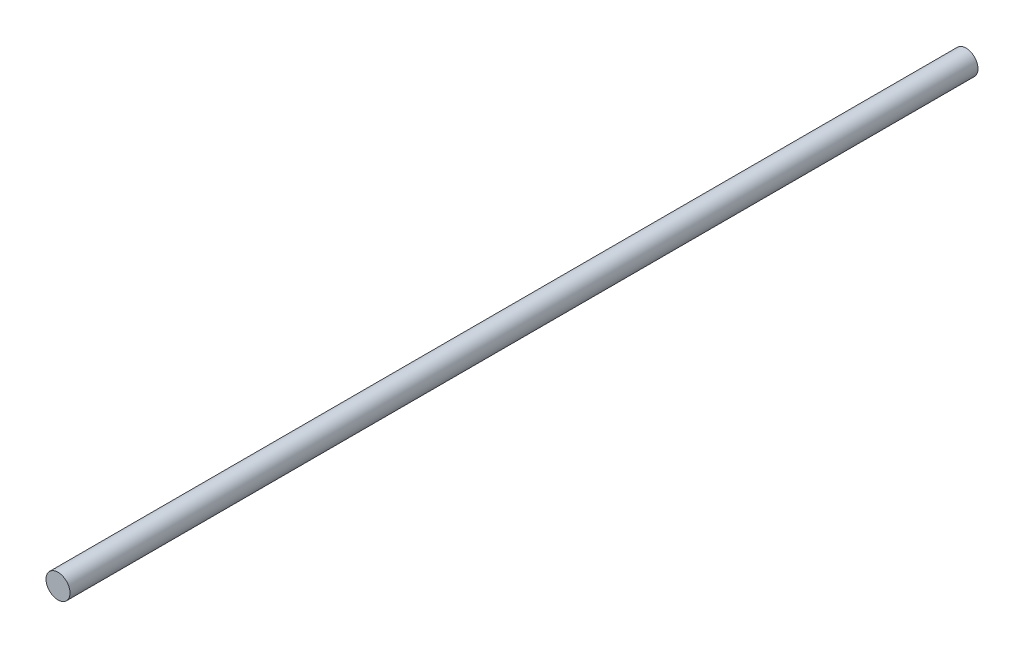
ISO-10303-21;
HEADER;
FILE_DESCRIPTION(('STEP AP214'),'2;1');
FILE_NAME('part.step','',(''),(''),'','','');
FILE_SCHEMA(('AUTOMOTIVE_DESIGN { 1 0 10303 214 1 1 1 1 }'));
ENDSEC;
DATA;
#1=APPLICATION_CONTEXT('core data for automotive mechanical design processes');
#2=APPLICATION_PROTOCOL_DEFINITION('international standard','automotive_design',2000,#1);
#3=PRODUCT_CONTEXT('',#1,'mechanical');
#4=PRODUCT('Part','Part','',(#3));
#5=PRODUCT_RELATED_PRODUCT_CATEGORY('part','',(#4));
#6=PRODUCT_DEFINITION_FORMATION('','',#4);
#7=PRODUCT_DEFINITION_CONTEXT('part definition',#1,'design');
#8=PRODUCT_DEFINITION('design','',#6,#7);
#9=PRODUCT_DEFINITION_SHAPE('','',#8);
#10=(LENGTH_UNIT() NAMED_UNIT(*) SI_UNIT(.MILLI.,.METRE.));
#11=(NAMED_UNIT(*) PLANE_ANGLE_UNIT() SI_UNIT($,.RADIAN.));
#12=(NAMED_UNIT(*) SI_UNIT($,.STERADIAN.) SOLID_ANGLE_UNIT());
#13=UNCERTAINTY_MEASURE_WITH_UNIT(LENGTH_MEASURE(1.E-05),#10,'distance_accuracy_value','');
#14=(GEOMETRIC_REPRESENTATION_CONTEXT(3) GLOBAL_UNCERTAINTY_ASSIGNED_CONTEXT((#13)) GLOBAL_UNIT_ASSIGNED_CONTEXT((#10,
#11,#12)) REPRESENTATION_CONTEXT('',''));
#15=CARTESIAN_POINT('',(0.,0.,0.));
#16=DIRECTION('',(0.,0.,1.));
#17=DIRECTION('',(1.,0.,0.));
#18=AXIS2_PLACEMENT_3D('',#15,#16,#17);
#19=CARTESIAN_POINT('',(0.,0.,90.));
#20=DIRECTION('',(0.,0.,-1.));
#21=DIRECTION('',(-1.,0.,0.));
#22=AXIS2_PLACEMENT_3D('',#19,#20,#21);
#23=CYLINDRICAL_SURFACE('',#22,2.38125);
#24=CARTESIAN_POINT('',(0.,0.,90.));
#25=DIRECTION('',(0.,0.,1.));
#26=DIRECTION('',(1.,0.,0.));
#27=AXIS2_PLACEMENT_3D('',#24,#25,#26);
#28=CIRCLE('',#27,2.38125);
#29=CARTESIAN_POINT('',(2.38125,0.,90.));
#30=VERTEX_POINT('',#29);
#31=EDGE_CURVE('E10',#30,#30,#28,.T.);
#32=ORIENTED_EDGE('',*,*,#31,.F.);
#33=EDGE_LOOP('',(#32));
#34=FACE_BOUND('',#33,.T.);
#35=CARTESIAN_POINT('',(0.,0.,-90.));
#36=DIRECTION('',(0.,0.,1.));
#37=DIRECTION('',(1.,0.,0.));
#38=AXIS2_PLACEMENT_3D('',#35,#36,#37);
#39=CIRCLE('',#38,2.38125);
#40=CARTESIAN_POINT('',(2.38125,0.,-90.));
#41=VERTEX_POINT('',#40);
#42=EDGE_CURVE('E34',#41,#41,#39,.T.);
#43=ORIENTED_EDGE('',*,*,#42,.T.);
#44=EDGE_LOOP('',(#43));
#45=FACE_BOUND('',#44,.T.);
#46=ADVANCED_FACE('F31',(#34,#45),#23,.T.);
#47=CARTESIAN_POINT('',(0.,0.,90.));
#48=DIRECTION('',(0.,0.,1.));
#49=DIRECTION('',(1.,0.,0.));
#50=AXIS2_PLACEMENT_3D('',#47,#48,#49);
#51=PLANE('',#50);
#52=ORIENTED_EDGE('',*,*,#31,.T.);
#53=EDGE_LOOP('',(#52));
#54=FACE_BOUND('',#53,.T.);
#55=ADVANCED_FACE('F46',(#54),#51,.T.);
#56=CARTESIAN_POINT('',(0.,0.,-90.));
#57=DIRECTION('',(0.,0.,1.));
#58=DIRECTION('',(1.,0.,0.));
#59=AXIS2_PLACEMENT_3D('',#56,#57,#58);
#60=PLANE('',#59);
#61=ORIENTED_EDGE('',*,*,#42,.F.);
#62=EDGE_LOOP('',(#61));
#63=FACE_BOUND('',#62,.T.);
#64=ADVANCED_FACE('F44',(#63),#60,.F.);
#65=CLOSED_SHELL('',(#46,#55,#64));
#66=MANIFOLD_SOLID_BREP('B2',#65);
#67=ADVANCED_BREP_SHAPE_REPRESENTATION('',(#18,#66),#14);
#68=SHAPE_DEFINITION_REPRESENTATION(#9,#67);
ENDSEC;
END-ISO-10303-21;
